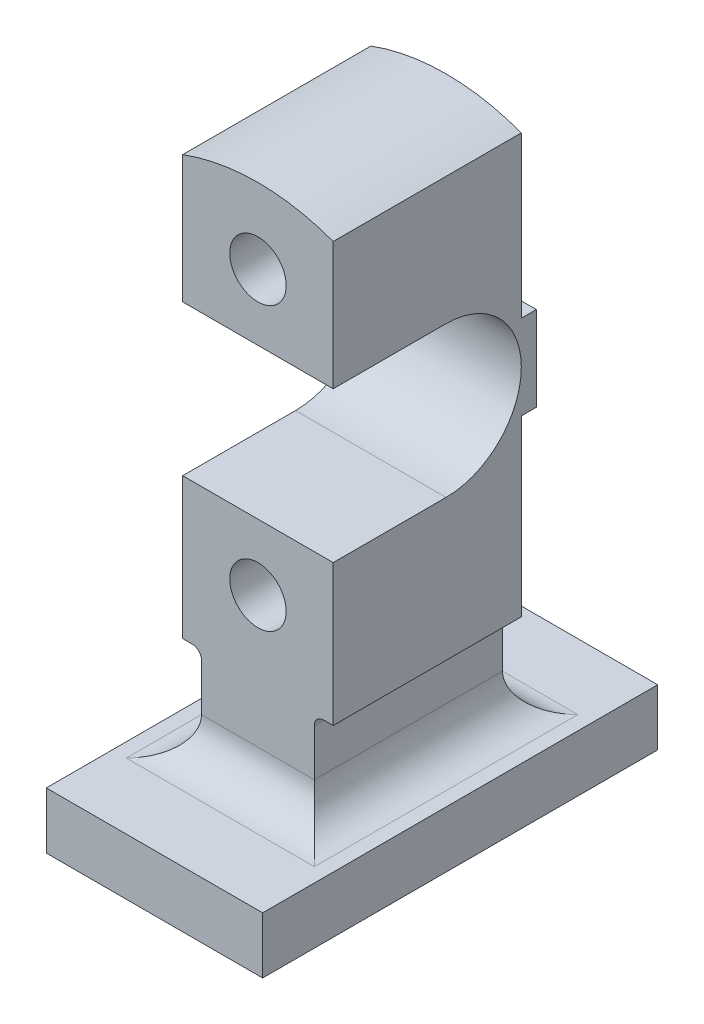
ISO-10303-21;
HEADER;
FILE_DESCRIPTION(('STEP AP214'),'2;1');
FILE_NAME('part.step','',(''),(''),'','','');
FILE_SCHEMA(('AUTOMOTIVE_DESIGN { 1 0 10303 214 1 1 1 1 }'));
ENDSEC;
DATA;
#1=APPLICATION_CONTEXT('core data for automotive mechanical design processes');
#2=APPLICATION_PROTOCOL_DEFINITION('international standard','automotive_design',2000,#1);
#3=PRODUCT_CONTEXT('',#1,'mechanical');
#4=PRODUCT('Part','Part','',(#3));
#5=PRODUCT_RELATED_PRODUCT_CATEGORY('part','',(#4));
#6=PRODUCT_DEFINITION_FORMATION('','',#4);
#7=PRODUCT_DEFINITION_CONTEXT('part definition',#1,'design');
#8=PRODUCT_DEFINITION('design','',#6,#7);
#9=PRODUCT_DEFINITION_SHAPE('','',#8);
#10=(LENGTH_UNIT() NAMED_UNIT(*) SI_UNIT(.MILLI.,.METRE.));
#11=(NAMED_UNIT(*) PLANE_ANGLE_UNIT() SI_UNIT($,.RADIAN.));
#12=(NAMED_UNIT(*) SI_UNIT($,.STERADIAN.) SOLID_ANGLE_UNIT());
#13=UNCERTAINTY_MEASURE_WITH_UNIT(LENGTH_MEASURE(1.E-05),#10,'distance_accuracy_value','');
#14=(GEOMETRIC_REPRESENTATION_CONTEXT(3) GLOBAL_UNCERTAINTY_ASSIGNED_CONTEXT((#13)) GLOBAL_UNIT_ASSIGNED_CONTEXT((#10,
#11,#12)) REPRESENTATION_CONTEXT('',''));
#15=CARTESIAN_POINT('',(0.,0.,0.));
#16=DIRECTION('',(0.,0.,1.));
#17=DIRECTION('',(1.,0.,0.));
#18=AXIS2_PLACEMENT_3D('',#15,#16,#17);
#19=CARTESIAN_POINT('',(115.,172.5,-155.));
#20=DIRECTION('',(0.,0.,1.));
#21=DIRECTION('',(1.,0.,0.));
#22=AXIS2_PLACEMENT_3D('',#19,#20,#21);
#23=PLANE('',#22);
#24=CARTESIAN_POINT('',(57.5,120.,-155.));
#25=DIRECTION('',(0.,0.,1.));
#26=DIRECTION('',(1.,0.,0.));
#27=AXIS2_PLACEMENT_3D('',#24,#25,#26);
#28=CIRCLE('',#27,15.);
#29=CARTESIAN_POINT('',(72.5,120.,-155.));
#30=VERTEX_POINT('',#29);
#31=EDGE_CURVE('E248',#30,#30,#28,.F.);
#32=ORIENTED_EDGE('',*,*,#31,.F.);
#33=EDGE_LOOP('',(#32));
#34=FACE_BOUND('',#33,.T.);
#35=DIRECTION('',(0.,1.,0.));
#36=VECTOR('',#35,1.);
#37=CARTESIAN_POINT('',(87.5000000000001,172.5,-155.));
#38=LINE('',#37,#36);
#39=CARTESIAN_POINT('',(87.5,50.0000000000001,-155.));
#40=VERTEX_POINT('',#39);
#41=CARTESIAN_POINT('',(87.5,75.,-155.));
#42=VERTEX_POINT('',#41);
#43=EDGE_CURVE('E297',#40,#42,#38,.T.);
#44=ORIENTED_EDGE('',*,*,#43,.F.);
#45=DIRECTION('',(-1.,0.,0.));
#46=VECTOR('',#45,1.);
#47=CARTESIAN_POINT('',(7.49999999999984,50.,-155.));
#48=LINE('',#47,#46);
#49=CARTESIAN_POINT('',(27.5,50.0000000000001,-155.));
#50=VERTEX_POINT('',#49);
#51=EDGE_CURVE('E227',#40,#50,#48,.T.);
#52=ORIENTED_EDGE('',*,*,#51,.T.);
#53=DIRECTION('',(0.,1.,0.));
#54=VECTOR('',#53,1.);
#55=CARTESIAN_POINT('',(27.5,172.5,-155.));
#56=LINE('',#55,#54);
#57=CARTESIAN_POINT('',(27.5,75.,-155.));
#58=VERTEX_POINT('',#57);
#59=EDGE_CURVE('E215',#50,#58,#56,.T.);
#60=ORIENTED_EDGE('',*,*,#59,.T.);
#61=CARTESIAN_POINT('',(22.5,75.,-155.));
#62=DIRECTION('',(0.,0.,1.));
#63=DIRECTION('',(1.,0.,0.));
#64=AXIS2_PLACEMENT_3D('',#61,#62,#63);
#65=CIRCLE('',#64,5.);
#66=CARTESIAN_POINT('',(22.5,80.,-155.));
#67=VERTEX_POINT('',#66);
#68=EDGE_CURVE('E291',#67,#58,#65,.F.);
#69=ORIENTED_EDGE('',*,*,#68,.F.);
#70=DIRECTION('',(1.,0.,0.));
#71=VECTOR('',#70,1.);
#72=CARTESIAN_POINT('',(115.,80.,-155.));
#73=LINE('',#72,#71);
#74=CARTESIAN_POINT('',(17.5,80.,-155.));
#75=VERTEX_POINT('',#74);
#76=EDGE_CURVE('E289',#75,#67,#73,.T.);
#77=ORIENTED_EDGE('',*,*,#76,.F.);
#78=DIRECTION('',(0.,1.,0.));
#79=VECTOR('',#78,1.);
#80=CARTESIAN_POINT('',(17.5,172.5,-155.));
#81=LINE('',#80,#79);
#82=CARTESIAN_POINT('',(17.5,172.5,-155.));
#83=VERTEX_POINT('',#82);
#84=EDGE_CURVE('E286',#75,#83,#81,.T.);
#85=ORIENTED_EDGE('',*,*,#84,.T.);
#86=DIRECTION('',(-1.,0.,0.));
#87=VECTOR('',#86,1.);
#88=CARTESIAN_POINT('',(115.,172.5,-155.));
#89=LINE('',#88,#87);
#90=CARTESIAN_POINT('',(97.5,172.5,-155.));
#91=VERTEX_POINT('',#90);
#92=EDGE_CURVE('E380',#91,#83,#89,.T.);
#93=ORIENTED_EDGE('',*,*,#92,.F.);
#94=DIRECTION('',(0.,1.,0.));
#95=VECTOR('',#94,1.);
#96=CARTESIAN_POINT('',(97.5,172.5,-155.));
#97=LINE('',#96,#95);
#98=CARTESIAN_POINT('',(97.5,80.,-155.));
#99=VERTEX_POINT('',#98);
#100=EDGE_CURVE('E333',#99,#91,#97,.T.);
#101=ORIENTED_EDGE('',*,*,#100,.F.);
#102=DIRECTION('',(1.,0.,0.));
#103=VECTOR('',#102,1.);
#104=CARTESIAN_POINT('',(115.,80.,-155.));
#105=LINE('',#104,#103);
#106=CARTESIAN_POINT('',(92.5,80.,-155.));
#107=VERTEX_POINT('',#106);
#108=EDGE_CURVE('E315',#107,#99,#105,.T.);
#109=ORIENTED_EDGE('',*,*,#108,.F.);
#110=CARTESIAN_POINT('',(92.5,75.,-155.));
#111=DIRECTION('',(0.,0.,1.));
#112=DIRECTION('',(1.,0.,0.));
#113=AXIS2_PLACEMENT_3D('',#110,#111,#112);
#114=CIRCLE('',#113,5.);
#115=EDGE_CURVE('E312',#107,#42,#114,.T.);
#116=ORIENTED_EDGE('',*,*,#115,.T.);
#117=EDGE_LOOP('',(#44,#52,#60,#69,#77,#85,#93,#101,#109,#116));
#118=FACE_BOUND('',#117,.T.);
#119=ADVANCED_FACE('F37',(#34,#118),#23,.F.);
#120=CARTESIAN_POINT('',(115.,155.,-55.));
#121=DIRECTION('',(0.,0.,-1.));
#122=DIRECTION('',(0.,1.,0.));
#123=AXIS2_PLACEMENT_3D('',#120,#121,#122);
#124=PLANE('',#123);
#125=CARTESIAN_POINT('',(57.5,120.,-55.));
#126=DIRECTION('',(0.,0.,-1.));
#127=DIRECTION('',(0.,1.,0.));
#128=AXIS2_PLACEMENT_3D('',#125,#126,#127);
#129=CIRCLE('',#128,15.);
#130=CARTESIAN_POINT('',(57.5,135.,-55.));
#131=VERTEX_POINT('',#130);
#132=EDGE_CURVE('E41',#131,#131,#129,.F.);
#133=ORIENTED_EDGE('',*,*,#132,.F.);
#134=EDGE_LOOP('',(#133));
#135=FACE_BOUND('',#134,.T.);
#136=DIRECTION('',(0.,-1.,0.));
#137=VECTOR('',#136,1.);
#138=CARTESIAN_POINT('',(27.5,155.,-55.));
#139=LINE('',#138,#137);
#140=CARTESIAN_POINT('',(27.5,75.,-55.));
#141=VERTEX_POINT('',#140);
#142=CARTESIAN_POINT('',(27.5,50.0000000000001,-55.));
#143=VERTEX_POINT('',#142);
#144=EDGE_CURVE('E212',#141,#143,#139,.T.);
#145=ORIENTED_EDGE('',*,*,#144,.T.);
#146=DIRECTION('',(-1.,0.,0.));
#147=VECTOR('',#146,1.);
#148=CARTESIAN_POINT('',(107.5,50.,-55.));
#149=LINE('',#148,#147);
#150=CARTESIAN_POINT('',(87.5,50.0000000000001,-55.));
#151=VERTEX_POINT('',#150);
#152=EDGE_CURVE('E223',#143,#151,#149,.F.);
#153=ORIENTED_EDGE('',*,*,#152,.T.);
#154=DIRECTION('',(0.,-1.,0.));
#155=VECTOR('',#154,1.);
#156=CARTESIAN_POINT('',(87.5,155.,-55.));
#157=LINE('',#156,#155);
#158=CARTESIAN_POINT('',(87.5,75.,-55.));
#159=VERTEX_POINT('',#158);
#160=EDGE_CURVE('E391',#159,#151,#157,.T.);
#161=ORIENTED_EDGE('',*,*,#160,.F.);
#162=CARTESIAN_POINT('',(92.5,75.,-55.));
#163=DIRECTION('',(0.,0.,-1.));
#164=DIRECTION('',(0.,1.,0.));
#165=AXIS2_PLACEMENT_3D('',#162,#163,#164);
#166=CIRCLE('',#165,5.);
#167=CARTESIAN_POINT('',(92.5,80.,-55.));
#168=VERTEX_POINT('',#167);
#169=EDGE_CURVE('E393',#159,#168,#166,.T.);
#170=ORIENTED_EDGE('',*,*,#169,.T.);
#171=DIRECTION('',(-1.,0.,0.));
#172=VECTOR('',#171,1.);
#173=CARTESIAN_POINT('',(115.,80.,-55.));
#174=LINE('',#173,#172);
#175=CARTESIAN_POINT('',(97.5,80.,-55.));
#176=VERTEX_POINT('',#175);
#177=EDGE_CURVE('E396',#176,#168,#174,.T.);
#178=ORIENTED_EDGE('',*,*,#177,.F.);
#179=DIRECTION('',(0.,-1.,0.));
#180=VECTOR('',#179,1.);
#181=CARTESIAN_POINT('',(97.5,155.,-55.));
#182=LINE('',#181,#180);
#183=CARTESIAN_POINT('',(97.5,155.,-55.));
#184=VERTEX_POINT('',#183);
#185=EDGE_CURVE('E398',#184,#176,#182,.T.);
#186=ORIENTED_EDGE('',*,*,#185,.F.);
#187=DIRECTION('',(-1.,0.,0.));
#188=VECTOR('',#187,1.);
#189=CARTESIAN_POINT('',(115.,155.,-55.));
#190=LINE('',#189,#188);
#191=CARTESIAN_POINT('',(17.5,155.,-55.));
#192=VERTEX_POINT('',#191);
#193=EDGE_CURVE('E359',#184,#192,#190,.T.);
#194=ORIENTED_EDGE('',*,*,#193,.T.);
#195=DIRECTION('',(0.,-1.,0.));
#196=VECTOR('',#195,1.);
#197=CARTESIAN_POINT('',(17.5,155.,-55.));
#198=LINE('',#197,#196);
#199=CARTESIAN_POINT('',(17.5,80.,-55.));
#200=VERTEX_POINT('',#199);
#201=EDGE_CURVE('E402',#192,#200,#198,.T.);
#202=ORIENTED_EDGE('',*,*,#201,.T.);
#203=DIRECTION('',(-1.,0.,0.));
#204=VECTOR('',#203,1.);
#205=CARTESIAN_POINT('',(115.,80.,-55.));
#206=LINE('',#205,#204);
#207=CARTESIAN_POINT('',(22.5,80.,-55.));
#208=VERTEX_POINT('',#207);
#209=EDGE_CURVE('E405',#208,#200,#206,.T.);
#210=ORIENTED_EDGE('',*,*,#209,.F.);
#211=CARTESIAN_POINT('',(22.5,75.,-55.));
#212=DIRECTION('',(0.,0.,-1.));
#213=DIRECTION('',(0.,1.,0.));
#214=AXIS2_PLACEMENT_3D('',#211,#212,#213);
#215=CIRCLE('',#214,5.);
#216=EDGE_CURVE('E226',#141,#208,#215,.F.);
#217=ORIENTED_EDGE('',*,*,#216,.F.);
#218=EDGE_LOOP('',(#145,#153,#161,#170,#178,#186,#194,#202,#210,#217));
#219=FACE_BOUND('',#218,.T.);
#220=ADVANCED_FACE('F221',(#135,#219),#124,.F.);
#221=CARTESIAN_POINT('',(115.,172.5,-163.));
#222=DIRECTION('',(0.,1.,0.));
#223=DIRECTION('',(0.,0.,1.));
#224=AXIS2_PLACEMENT_3D('',#221,#222,#223);
#225=PLANE('',#224);
#226=ORIENTED_EDGE('',*,*,#92,.T.);
#227=DIRECTION('',(0.,0.,-1.));
#228=VECTOR('',#227,1.);
#229=CARTESIAN_POINT('',(17.5,172.5,-163.));
#230=LINE('',#229,#228);
#231=CARTESIAN_POINT('',(17.5,172.5,-163.));
#232=VERTEX_POINT('',#231);
#233=EDGE_CURVE('E283',#83,#232,#230,.T.);
#234=ORIENTED_EDGE('',*,*,#233,.T.);
#235=DIRECTION('',(-1.,0.,0.));
#236=VECTOR('',#235,1.);
#237=CARTESIAN_POINT('',(115.,172.5,-163.));
#238=LINE('',#237,#236);
#239=CARTESIAN_POINT('',(97.5,172.5,-163.));
#240=VERTEX_POINT('',#239);
#241=EDGE_CURVE('E377',#240,#232,#238,.T.);
#242=ORIENTED_EDGE('',*,*,#241,.F.);
#243=DIRECTION('',(0.,0.,-1.));
#244=VECTOR('',#243,1.);
#245=CARTESIAN_POINT('',(97.5,172.5,-163.));
#246=LINE('',#245,#244);
#247=EDGE_CURVE('E331',#91,#240,#246,.T.);
#248=ORIENTED_EDGE('',*,*,#247,.F.);
#249=EDGE_LOOP('',(#226,#234,#242,#248));
#250=FACE_BOUND('',#249,.T.);
#251=ADVANCED_FACE('F439',(#250),#225,.F.);
#252=CARTESIAN_POINT('',(115.,217.5,-163.));
#253=DIRECTION('',(0.,0.,1.));
#254=DIRECTION('',(1.,0.,0.));
#255=AXIS2_PLACEMENT_3D('',#252,#253,#254);
#256=PLANE('',#255);
#257=ORIENTED_EDGE('',*,*,#241,.T.);
#258=DIRECTION('',(0.,1.,0.));
#259=VECTOR('',#258,1.);
#260=CARTESIAN_POINT('',(17.5,217.5,-163.));
#261=LINE('',#260,#259);
#262=CARTESIAN_POINT('',(17.5,217.5,-163.));
#263=VERTEX_POINT('',#262);
#264=EDGE_CURVE('E280',#232,#263,#261,.T.);
#265=ORIENTED_EDGE('',*,*,#264,.T.);
#266=DIRECTION('',(-1.,0.,0.));
#267=VECTOR('',#266,1.);
#268=CARTESIAN_POINT('',(115.,217.5,-163.));
#269=LINE('',#268,#267);
#270=CARTESIAN_POINT('',(97.5,217.5,-163.));
#271=VERTEX_POINT('',#270);
#272=EDGE_CURVE('E374',#271,#263,#269,.T.);
#273=ORIENTED_EDGE('',*,*,#272,.F.);
#274=DIRECTION('',(0.,1.,0.));
#275=VECTOR('',#274,1.);
#276=CARTESIAN_POINT('',(97.5,217.5,-163.));
#277=LINE('',#276,#275);
#278=EDGE_CURVE('E329',#240,#271,#277,.T.);
#279=ORIENTED_EDGE('',*,*,#278,.F.);
#280=EDGE_LOOP('',(#257,#265,#273,#279));
#281=FACE_BOUND('',#280,.T.);
#282=ADVANCED_FACE('F502',(#281),#256,.F.);
#283=CARTESIAN_POINT('',(115.,217.5,-163.));
#284=DIRECTION('',(0.,-1.,0.));
#285=DIRECTION('',(0.,0.,-1.));
#286=AXIS2_PLACEMENT_3D('',#283,#284,#285);
#287=PLANE('',#286);
#288=ORIENTED_EDGE('',*,*,#272,.T.);
#289=DIRECTION('',(0.,0.,1.));
#290=VECTOR('',#289,1.);
#291=CARTESIAN_POINT('',(17.5,217.5,-163.));
#292=LINE('',#291,#290);
#293=CARTESIAN_POINT('',(17.5,217.5,-155.));
#294=VERTEX_POINT('',#293);
#295=EDGE_CURVE('E277',#263,#294,#292,.T.);
#296=ORIENTED_EDGE('',*,*,#295,.T.);
#297=DIRECTION('',(-1.,0.,0.));
#298=VECTOR('',#297,1.);
#299=CARTESIAN_POINT('',(115.,217.5,-155.));
#300=LINE('',#299,#298);
#301=CARTESIAN_POINT('',(97.5,217.5,-155.));
#302=VERTEX_POINT('',#301);
#303=EDGE_CURVE('E371',#302,#294,#300,.T.);
#304=ORIENTED_EDGE('',*,*,#303,.F.);
#305=DIRECTION('',(0.,0.,1.));
#306=VECTOR('',#305,1.);
#307=CARTESIAN_POINT('',(97.5,217.5,-163.));
#308=LINE('',#307,#306);
#309=EDGE_CURVE('E327',#271,#302,#308,.T.);
#310=ORIENTED_EDGE('',*,*,#309,.F.);
#311=EDGE_LOOP('',(#288,#296,#304,#310));
#312=FACE_BOUND('',#311,.T.);
#313=ADVANCED_FACE('F499',(#312),#287,.F.);
#314=CARTESIAN_POINT('',(115.,310.,-155.));
#315=DIRECTION('',(0.,0.,1.));
#316=DIRECTION('',(1.,0.,0.));
#317=AXIS2_PLACEMENT_3D('',#314,#315,#316);
#318=PLANE('',#317);
#319=CARTESIAN_POINT('',(57.5,270.,-155.));
#320=DIRECTION('',(0.,0.,1.));
#321=DIRECTION('',(1.,0.,0.));
#322=AXIS2_PLACEMENT_3D('',#319,#320,#321);
#323=CIRCLE('',#322,15.);
#324=CARTESIAN_POINT('',(72.5,270.,-155.));
#325=VERTEX_POINT('',#324);
#326=EDGE_CURVE('E240',#325,#325,#323,.F.);
#327=ORIENTED_EDGE('',*,*,#326,.F.);
#328=EDGE_LOOP('',(#327));
#329=FACE_BOUND('',#328,.T.);
#330=ORIENTED_EDGE('',*,*,#303,.T.);
#331=DIRECTION('',(0.,1.,0.));
#332=VECTOR('',#331,1.);
#333=CARTESIAN_POINT('',(17.5,310.,-155.));
#334=LINE('',#333,#332);
#335=CARTESIAN_POINT('',(17.5,302.819293264239,-155.));
#336=VERTEX_POINT('',#335);
#337=EDGE_CURVE('E274',#294,#336,#334,.T.);
#338=ORIENTED_EDGE('',*,*,#337,.T.);
#339=CARTESIAN_POINT('',(57.5,195.,-155.));
#340=DIRECTION('',(0.,0.,1.));
#341=DIRECTION('',(1.,0.,0.));
#342=AXIS2_PLACEMENT_3D('',#339,#340,#341);
#343=CIRCLE('',#342,115.);
#344=CARTESIAN_POINT('',(97.5,302.819293264239,-155.));
#345=VERTEX_POINT('',#344);
#346=EDGE_CURVE('E335',#345,#336,#343,.T.);
#347=ORIENTED_EDGE('',*,*,#346,.F.);
#348=DIRECTION('',(0.,1.,0.));
#349=VECTOR('',#348,1.);
#350=CARTESIAN_POINT('',(97.5,310.,-155.));
#351=LINE('',#350,#349);
#352=EDGE_CURVE('E325',#302,#345,#351,.T.);
#353=ORIENTED_EDGE('',*,*,#352,.F.);
#354=EDGE_LOOP('',(#330,#338,#347,#353));
#355=FACE_BOUND('',#354,.T.);
#356=ADVANCED_FACE('F495',(#329,#355),#318,.F.);
#357=CARTESIAN_POINT('',(115.,310.,-55.));
#358=DIRECTION('',(0.,0.,-1.));
#359=DIRECTION('',(0.,1.,0.));
#360=AXIS2_PLACEMENT_3D('',#357,#358,#359);
#361=PLANE('',#360);
#362=CARTESIAN_POINT('',(57.5,270.,-55.));
#363=DIRECTION('',(0.,0.,-1.));
#364=DIRECTION('',(0.,1.,0.));
#365=AXIS2_PLACEMENT_3D('',#362,#363,#364);
#366=CIRCLE('',#365,15.);
#367=CARTESIAN_POINT('',(57.5,285.,-55.));
#368=VERTEX_POINT('',#367);
#369=EDGE_CURVE('E238',#368,#368,#366,.F.);
#370=ORIENTED_EDGE('',*,*,#369,.F.);
#371=EDGE_LOOP('',(#370));
#372=FACE_BOUND('',#371,.T.);
#373=CARTESIAN_POINT('',(57.5,195.,-55.));
#374=DIRECTION('',(0.,0.,-1.));
#375=DIRECTION('',(0.,1.,0.));
#376=AXIS2_PLACEMENT_3D('',#373,#374,#375);
#377=CIRCLE('',#376,115.);
#378=CARTESIAN_POINT('',(17.5,302.819293264239,-55.));
#379=VERTEX_POINT('',#378);
#380=CARTESIAN_POINT('',(97.5,302.819293264239,-55.));
#381=VERTEX_POINT('',#380);
#382=EDGE_CURVE('E400',#379,#381,#377,.T.);
#383=ORIENTED_EDGE('',*,*,#382,.F.);
#384=DIRECTION('',(0.,-1.,0.));
#385=VECTOR('',#384,1.);
#386=CARTESIAN_POINT('',(17.5,310.,-55.));
#387=LINE('',#386,#385);
#388=CARTESIAN_POINT('',(17.5,235.,-55.));
#389=VERTEX_POINT('',#388);
#390=EDGE_CURVE('E271',#379,#389,#387,.T.);
#391=ORIENTED_EDGE('',*,*,#390,.T.);
#392=DIRECTION('',(-1.,0.,0.));
#393=VECTOR('',#392,1.);
#394=CARTESIAN_POINT('',(115.,235.,-55.));
#395=LINE('',#394,#393);
#396=CARTESIAN_POINT('',(97.5,235.,-55.));
#397=VERTEX_POINT('',#396);
#398=EDGE_CURVE('E368',#397,#389,#395,.T.);
#399=ORIENTED_EDGE('',*,*,#398,.F.);
#400=DIRECTION('',(0.,-1.,0.));
#401=VECTOR('',#400,1.);
#402=CARTESIAN_POINT('',(97.5,310.,-55.));
#403=LINE('',#402,#401);
#404=EDGE_CURVE('E323',#381,#397,#403,.T.);
#405=ORIENTED_EDGE('',*,*,#404,.F.);
#406=EDGE_LOOP('',(#383,#391,#399,#405));
#407=FACE_BOUND('',#406,.T.);
#408=ADVANCED_FACE('F491',(#372,#407),#361,.F.);
#409=CARTESIAN_POINT('',(115.,235.,-55.));
#410=DIRECTION('',(0.,1.,0.));
#411=DIRECTION('',(0.,0.,1.));
#412=AXIS2_PLACEMENT_3D('',#409,#410,#411);
#413=PLANE('',#412);
#414=ORIENTED_EDGE('',*,*,#398,.T.);
#415=DIRECTION('',(0.,0.,-1.));
#416=VECTOR('',#415,1.);
#417=CARTESIAN_POINT('',(17.5,235.,-55.));
#418=LINE('',#417,#416);
#419=CARTESIAN_POINT('',(17.5,235.,-115.));
#420=VERTEX_POINT('',#419);
#421=EDGE_CURVE('E268',#389,#420,#418,.T.);
#422=ORIENTED_EDGE('',*,*,#421,.T.);
#423=DIRECTION('',(-1.,0.,0.));
#424=VECTOR('',#423,1.);
#425=CARTESIAN_POINT('',(115.,235.,-115.));
#426=LINE('',#425,#424);
#427=CARTESIAN_POINT('',(97.5,235.,-115.));
#428=VERTEX_POINT('',#427);
#429=EDGE_CURVE('E365',#428,#420,#426,.T.);
#430=ORIENTED_EDGE('',*,*,#429,.F.);
#431=DIRECTION('',(0.,0.,-1.));
#432=VECTOR('',#431,1.);
#433=CARTESIAN_POINT('',(97.5,235.,-55.));
#434=LINE('',#433,#432);
#435=EDGE_CURVE('E321',#397,#428,#434,.T.);
#436=ORIENTED_EDGE('',*,*,#435,.F.);
#437=EDGE_LOOP('',(#414,#422,#430,#436));
#438=FACE_BOUND('',#437,.T.);
#439=ADVANCED_FACE('F487',(#438),#413,.F.);
#440=CARTESIAN_POINT('',(115.,195.,-115.));
#441=DIRECTION('',(-1.,0.,0.));
#442=DIRECTION('',(0.,0.,1.));
#443=AXIS2_PLACEMENT_3D('',#440,#441,#442);
#444=CYLINDRICAL_SURFACE('',#443,40.);
#445=ORIENTED_EDGE('',*,*,#429,.T.);
#446=CARTESIAN_POINT('',(17.5,195.,-115.));
#447=DIRECTION('',(1.,0.,0.));
#448=DIRECTION('',(0.,1.,0.));
#449=AXIS2_PLACEMENT_3D('',#446,#447,#448);
#450=CIRCLE('',#449,40.);
#451=CARTESIAN_POINT('',(17.5,155.,-115.));
#452=VERTEX_POINT('',#451);
#453=EDGE_CURVE('E265',#420,#452,#450,.F.);
#454=ORIENTED_EDGE('',*,*,#453,.T.);
#455=DIRECTION('',(-1.,0.,0.));
#456=VECTOR('',#455,1.);
#457=CARTESIAN_POINT('',(115.,155.,-115.));
#458=LINE('',#457,#456);
#459=CARTESIAN_POINT('',(97.5,155.,-115.));
#460=VERTEX_POINT('',#459);
#461=EDGE_CURVE('E362',#460,#452,#458,.T.);
#462=ORIENTED_EDGE('',*,*,#461,.F.);
#463=CARTESIAN_POINT('',(97.5,195.,-115.));
#464=DIRECTION('',(1.,0.,0.));
#465=DIRECTION('',(0.,1.,0.));
#466=AXIS2_PLACEMENT_3D('',#463,#464,#465);
#467=CIRCLE('',#466,40.);
#468=EDGE_CURVE('E319',#428,#460,#467,.F.);
#469=ORIENTED_EDGE('',*,*,#468,.F.);
#470=EDGE_LOOP('',(#445,#454,#462,#469));
#471=FACE_BOUND('',#470,.T.);
#472=ADVANCED_FACE('F460',(#471),#444,.F.);
#473=CARTESIAN_POINT('',(115.,155.,-55.));
#474=DIRECTION('',(0.,-1.,0.));
#475=DIRECTION('',(0.,0.,-1.));
#476=AXIS2_PLACEMENT_3D('',#473,#474,#475);
#477=PLANE('',#476);
#478=ORIENTED_EDGE('',*,*,#461,.T.);
#479=DIRECTION('',(0.,0.,1.));
#480=VECTOR('',#479,1.);
#481=CARTESIAN_POINT('',(17.5,155.,-55.));
#482=LINE('',#481,#480);
#483=EDGE_CURVE('E216',#452,#192,#482,.T.);
#484=ORIENTED_EDGE('',*,*,#483,.T.);
#485=ORIENTED_EDGE('',*,*,#193,.F.);
#486=DIRECTION('',(0.,0.,1.));
#487=VECTOR('',#486,1.);
#488=CARTESIAN_POINT('',(97.5,155.,-55.));
#489=LINE('',#488,#487);
#490=EDGE_CURVE('E317',#460,#184,#489,.T.);
#491=ORIENTED_EDGE('',*,*,#490,.F.);
#492=EDGE_LOOP('',(#478,#484,#485,#491));
#493=FACE_BOUND('',#492,.T.);
#494=ADVANCED_FACE('F455',(#493),#477,.F.);
#495=CARTESIAN_POINT('',(115.,0.,0.));
#496=DIRECTION('',(0.,0.,-1.));
#497=DIRECTION('',(-1.,0.,0.));
#498=AXIS2_PLACEMENT_3D('',#495,#496,#497);
#499=PLANE('',#498);
#500=DIRECTION('',(0.,-1.,0.));
#501=VECTOR('',#500,1.);
#502=CARTESIAN_POINT('',(0.,0.,0.));
#503=LINE('',#502,#501);
#504=CARTESIAN_POINT('',(0.,30.,0.));
#505=VERTEX_POINT('',#504);
#506=CARTESIAN_POINT('',(0.,0.,0.));
#507=VERTEX_POINT('',#506);
#508=EDGE_CURVE('E337',#505,#507,#503,.T.);
#509=ORIENTED_EDGE('',*,*,#508,.T.);
#510=DIRECTION('',(-1.,0.,0.));
#511=VECTOR('',#510,1.);
#512=CARTESIAN_POINT('',(115.,0.,0.));
#513=LINE('',#512,#511);
#514=CARTESIAN_POINT('',(115.,0.,0.));
#515=VERTEX_POINT('',#514);
#516=EDGE_CURVE('E388',#515,#507,#513,.T.);
#517=ORIENTED_EDGE('',*,*,#516,.F.);
#518=DIRECTION('',(0.,-1.,0.));
#519=VECTOR('',#518,1.);
#520=CARTESIAN_POINT('',(115.,0.,0.));
#521=LINE('',#520,#519);
#522=CARTESIAN_POINT('',(115.,30.,0.));
#523=VERTEX_POINT('',#522);
#524=EDGE_CURVE('E338',#523,#515,#521,.T.);
#525=ORIENTED_EDGE('',*,*,#524,.F.);
#526=DIRECTION('',(-1.,0.,0.));
#527=VECTOR('',#526,1.);
#528=CARTESIAN_POINT('',(115.,30.,0.));
#529=LINE('',#528,#527);
#530=EDGE_CURVE('E348',#523,#505,#529,.T.);
#531=ORIENTED_EDGE('',*,*,#530,.T.);
#532=EDGE_LOOP('',(#509,#517,#525,#531));
#533=FACE_BOUND('',#532,.T.);
#534=ADVANCED_FACE('F452',(#533),#499,.F.);
#535=CARTESIAN_POINT('',(115.,0.,0.));
#536=DIRECTION('',(0.,1.,0.));
#537=DIRECTION('',(0.,0.,1.));
#538=AXIS2_PLACEMENT_3D('',#535,#536,#537);
#539=PLANE('',#538);
#540=DIRECTION('',(0.,0.,-1.));
#541=VECTOR('',#540,1.);
#542=CARTESIAN_POINT('',(0.,0.,0.));
#543=LINE('',#542,#541);
#544=CARTESIAN_POINT('',(0.,0.,-210.));
#545=VERTEX_POINT('',#544);
#546=EDGE_CURVE('E351',#507,#545,#543,.T.);
#547=ORIENTED_EDGE('',*,*,#546,.T.);
#548=DIRECTION('',(-1.,0.,0.));
#549=VECTOR('',#548,1.);
#550=CARTESIAN_POINT('',(115.,0.,-210.));
#551=LINE('',#550,#549);
#552=CARTESIAN_POINT('',(115.,0.,-210.));
#553=VERTEX_POINT('',#552);
#554=EDGE_CURVE('E385',#553,#545,#551,.T.);
#555=ORIENTED_EDGE('',*,*,#554,.F.);
#556=DIRECTION('',(0.,0.,-1.));
#557=VECTOR('',#556,1.);
#558=CARTESIAN_POINT('',(115.,0.,0.));
#559=LINE('',#558,#557);
#560=EDGE_CURVE('E341',#515,#553,#559,.T.);
#561=ORIENTED_EDGE('',*,*,#560,.F.);
#562=ORIENTED_EDGE('',*,*,#516,.T.);
#563=EDGE_LOOP('',(#547,#555,#561,#562));
#564=FACE_BOUND('',#563,.T.);
#565=ADVANCED_FACE('F449',(#564),#539,.F.);
#566=CARTESIAN_POINT('',(115.,0.,-210.));
#567=DIRECTION('',(0.,0.,1.));
#568=DIRECTION('',(1.,0.,0.));
#569=AXIS2_PLACEMENT_3D('',#566,#567,#568);
#570=PLANE('',#569);
#571=DIRECTION('',(0.,1.,0.));
#572=VECTOR('',#571,1.);
#573=CARTESIAN_POINT('',(0.,0.,-210.));
#574=LINE('',#573,#572);
#575=CARTESIAN_POINT('',(0.,30.,-210.));
#576=VERTEX_POINT('',#575);
#577=EDGE_CURVE('E353',#545,#576,#574,.T.);
#578=ORIENTED_EDGE('',*,*,#577,.T.);
#579=DIRECTION('',(-1.,0.,0.));
#580=VECTOR('',#579,1.);
#581=CARTESIAN_POINT('',(115.,30.,-210.));
#582=LINE('',#581,#580);
#583=CARTESIAN_POINT('',(115.,30.,-210.));
#584=VERTEX_POINT('',#583);
#585=EDGE_CURVE('E383',#584,#576,#582,.T.);
#586=ORIENTED_EDGE('',*,*,#585,.F.);
#587=DIRECTION('',(0.,1.,0.));
#588=VECTOR('',#587,1.);
#589=CARTESIAN_POINT('',(115.,0.,-210.));
#590=LINE('',#589,#588);
#591=EDGE_CURVE('E344',#553,#584,#590,.T.);
#592=ORIENTED_EDGE('',*,*,#591,.F.);
#593=ORIENTED_EDGE('',*,*,#554,.T.);
#594=EDGE_LOOP('',(#578,#586,#592,#593));
#595=FACE_BOUND('',#594,.T.);
#596=ADVANCED_FACE('F446',(#595),#570,.F.);
#597=CARTESIAN_POINT('',(115.,30.,0.));
#598=DIRECTION('',(0.,-1.,0.));
#599=DIRECTION('',(0.,0.,-1.));
#600=AXIS2_PLACEMENT_3D('',#597,#598,#599);
#601=PLANE('',#600);
#602=DIRECTION('',(0.,0.,-1.));
#603=VECTOR('',#602,1.);
#604=CARTESIAN_POINT('',(7.49999999999984,30.,0.));
#605=LINE('',#604,#603);
#606=CARTESIAN_POINT('',(7.49999999999984,30.,-35.));
#607=VERTEX_POINT('',#606);
#608=CARTESIAN_POINT('',(7.49999999999984,30.,-175.));
#609=VERTEX_POINT('',#608);
#610=EDGE_CURVE('E54',#607,#609,#605,.T.);
#611=ORIENTED_EDGE('',*,*,#610,.T.);
#612=DIRECTION('',(-1.,0.,0.));
#613=VECTOR('',#612,1.);
#614=CARTESIAN_POINT('',(107.5,30.,-175.));
#615=LINE('',#614,#613);
#616=CARTESIAN_POINT('',(107.5,30.,-175.));
#617=VERTEX_POINT('',#616);
#618=EDGE_CURVE('E231',#609,#617,#615,.F.);
#619=ORIENTED_EDGE('',*,*,#618,.T.);
#620=DIRECTION('',(0.,0.,-1.));
#621=VECTOR('',#620,1.);
#622=CARTESIAN_POINT('',(107.5,30.,0.));
#623=LINE('',#622,#621);
#624=CARTESIAN_POINT('',(107.5,30.,-35.));
#625=VERTEX_POINT('',#624);
#626=EDGE_CURVE('E61',#625,#617,#623,.T.);
#627=ORIENTED_EDGE('',*,*,#626,.F.);
#628=DIRECTION('',(-1.,0.,0.));
#629=VECTOR('',#628,1.);
#630=CARTESIAN_POINT('',(7.49999999999984,30.,-35.));
#631=LINE('',#630,#629);
#632=EDGE_CURVE('E234',#625,#607,#631,.T.);
#633=ORIENTED_EDGE('',*,*,#632,.T.);
#634=EDGE_LOOP('',(#611,#619,#627,#633));
#635=FACE_BOUND('',#634,.T.);
#636=ORIENTED_EDGE('',*,*,#585,.T.);
#637=DIRECTION('',(0.,0.,1.));
#638=VECTOR('',#637,1.);
#639=CARTESIAN_POINT('',(0.,30.,0.));
#640=LINE('',#639,#638);
#641=EDGE_CURVE('E342',#576,#505,#640,.T.);
#642=ORIENTED_EDGE('',*,*,#641,.T.);
#643=ORIENTED_EDGE('',*,*,#530,.F.);
#644=DIRECTION('',(0.,0.,1.));
#645=VECTOR('',#644,1.);
#646=CARTESIAN_POINT('',(115.,30.,-155.));
#647=LINE('',#646,#645);
#648=EDGE_CURVE('E346',#584,#523,#647,.T.);
#649=ORIENTED_EDGE('',*,*,#648,.F.);
#650=EDGE_LOOP('',(#636,#642,#643,#649));
#651=FACE_BOUND('',#650,.T.);
#652=ADVANCED_FACE('F409',(#635,#651),#601,.F.);
#653=CARTESIAN_POINT('',(115.,195.,-115.));
#654=DIRECTION('',(1.,0.,0.));
#655=DIRECTION('',(0.,0.,-1.));
#656=AXIS2_PLACEMENT_3D('',#653,#654,#655);
#657=PLANE('',#656);
#658=ORIENTED_EDGE('',*,*,#648,.T.);
#659=ORIENTED_EDGE('',*,*,#524,.T.);
#660=ORIENTED_EDGE('',*,*,#560,.T.);
#661=ORIENTED_EDGE('',*,*,#591,.T.);
#662=EDGE_LOOP('',(#658,#659,#660,#661));
#663=FACE_BOUND('',#662,.T.);
#664=ADVANCED_FACE('F474',(#663),#657,.T.);
#665=CARTESIAN_POINT('',(0.,195.,-115.));
#666=DIRECTION('',(1.,0.,0.));
#667=DIRECTION('',(0.,0.,-1.));
#668=AXIS2_PLACEMENT_3D('',#665,#666,#667);
#669=PLANE('',#668);
#670=ORIENTED_EDGE('',*,*,#641,.F.);
#671=ORIENTED_EDGE('',*,*,#577,.F.);
#672=ORIENTED_EDGE('',*,*,#546,.F.);
#673=ORIENTED_EDGE('',*,*,#508,.F.);
#674=EDGE_LOOP('',(#670,#671,#672,#673));
#675=FACE_BOUND('',#674,.T.);
#676=ADVANCED_FACE('F469',(#675),#669,.F.);
#677=CARTESIAN_POINT('',(57.5,195.,0.));
#678=DIRECTION('',(0.,0.,-1.));
#679=DIRECTION('',(-1.,0.,0.));
#680=AXIS2_PLACEMENT_3D('',#677,#678,#679);
#681=CYLINDRICAL_SURFACE('',#680,115.);
#682=ORIENTED_EDGE('',*,*,#346,.T.);
#683=DIRECTION('',(0.,0.,-1.));
#684=VECTOR('',#683,1.);
#685=CARTESIAN_POINT('',(17.5,302.819293264239,0.));
#686=LINE('',#685,#684);
#687=EDGE_CURVE('E259',#379,#336,#686,.T.);
#688=ORIENTED_EDGE('',*,*,#687,.F.);
#689=ORIENTED_EDGE('',*,*,#382,.T.);
#690=DIRECTION('',(0.,0.,-1.));
#691=VECTOR('',#690,1.);
#692=CARTESIAN_POINT('',(97.5,302.819293264239,0.));
#693=LINE('',#692,#691);
#694=EDGE_CURVE('E294',#381,#345,#693,.T.);
#695=ORIENTED_EDGE('',*,*,#694,.T.);
#696=EDGE_LOOP('',(#682,#688,#689,#695));
#697=FACE_BOUND('',#696,.T.);
#698=ADVANCED_FACE('F541',(#697),#681,.T.);
#699=CARTESIAN_POINT('',(97.5,0.,0.));
#700=DIRECTION('',(1.,0.,0.));
#701=DIRECTION('',(0.,1.,0.));
#702=AXIS2_PLACEMENT_3D('',#699,#700,#701);
#703=PLANE('',#702);
#704=ORIENTED_EDGE('',*,*,#100,.T.);
#705=ORIENTED_EDGE('',*,*,#247,.T.);
#706=ORIENTED_EDGE('',*,*,#278,.T.);
#707=ORIENTED_EDGE('',*,*,#309,.T.);
#708=ORIENTED_EDGE('',*,*,#352,.T.);
#709=ORIENTED_EDGE('',*,*,#694,.F.);
#710=ORIENTED_EDGE('',*,*,#404,.T.);
#711=ORIENTED_EDGE('',*,*,#435,.T.);
#712=ORIENTED_EDGE('',*,*,#468,.T.);
#713=ORIENTED_EDGE('',*,*,#490,.T.);
#714=ORIENTED_EDGE('',*,*,#185,.T.);
#715=DIRECTION('',(0.,0.,-1.));
#716=VECTOR('',#715,1.);
#717=CARTESIAN_POINT('',(97.5,80.,0.));
#718=LINE('',#717,#716);
#719=EDGE_CURVE('E298',#176,#99,#718,.T.);
#720=ORIENTED_EDGE('',*,*,#719,.T.);
#721=EDGE_LOOP('',(#704,#705,#706,#707,#708,#709,#710,#711,#712,#713,#714,#720));
#722=FACE_BOUND('',#721,.T.);
#723=ADVANCED_FACE('F537',(#722),#703,.T.);
#724=CARTESIAN_POINT('',(0.,80.,0.));
#725=DIRECTION('',(0.,-1.,0.));
#726=DIRECTION('',(0.,0.,-1.));
#727=AXIS2_PLACEMENT_3D('',#724,#725,#726);
#728=PLANE('',#727);
#729=ORIENTED_EDGE('',*,*,#108,.T.);
#730=ORIENTED_EDGE('',*,*,#719,.F.);
#731=ORIENTED_EDGE('',*,*,#177,.T.);
#732=DIRECTION('',(0.,0.,-1.));
#733=VECTOR('',#732,1.);
#734=CARTESIAN_POINT('',(92.5,80.,0.));
#735=LINE('',#734,#733);
#736=EDGE_CURVE('E301',#168,#107,#735,.T.);
#737=ORIENTED_EDGE('',*,*,#736,.T.);
#738=EDGE_LOOP('',(#729,#730,#731,#737));
#739=FACE_BOUND('',#738,.T.);
#740=ADVANCED_FACE('F540',(#739),#728,.T.);
#741=CARTESIAN_POINT('',(92.5,75.,0.));
#742=DIRECTION('',(0.,0.,-1.));
#743=DIRECTION('',(-1.,0.,0.));
#744=AXIS2_PLACEMENT_3D('',#741,#742,#743);
#745=CYLINDRICAL_SURFACE('',#744,5.);
#746=ORIENTED_EDGE('',*,*,#736,.F.);
#747=ORIENTED_EDGE('',*,*,#169,.F.);
#748=DIRECTION('',(0.,0.,-1.));
#749=VECTOR('',#748,1.);
#750=CARTESIAN_POINT('',(87.5,75.,0.));
#751=LINE('',#750,#749);
#752=EDGE_CURVE('E304',#159,#42,#751,.T.);
#753=ORIENTED_EDGE('',*,*,#752,.T.);
#754=ORIENTED_EDGE('',*,*,#115,.F.);
#755=EDGE_LOOP('',(#746,#747,#753,#754));
#756=FACE_BOUND('',#755,.T.);
#757=ADVANCED_FACE('F545',(#756),#745,.F.);
#758=CARTESIAN_POINT('',(87.5,0.,0.));
#759=DIRECTION('',(1.,0.,0.));
#760=DIRECTION('',(0.,1.,0.));
#761=AXIS2_PLACEMENT_3D('',#758,#759,#760);
#762=PLANE('',#761);
#763=ORIENTED_EDGE('',*,*,#43,.T.);
#764=ORIENTED_EDGE('',*,*,#752,.F.);
#765=ORIENTED_EDGE('',*,*,#160,.T.);
#766=DIRECTION('',(0.,0.,-1.));
#767=VECTOR('',#766,1.);
#768=CARTESIAN_POINT('',(87.5,50.0000000000001,0.));
#769=LINE('',#768,#767);
#770=EDGE_CURVE('E307',#151,#40,#769,.T.);
#771=ORIENTED_EDGE('',*,*,#770,.T.);
#772=EDGE_LOOP('',(#763,#764,#765,#771));
#773=FACE_BOUND('',#772,.T.);
#774=ADVANCED_FACE('F417',(#773),#762,.T.);
#775=CARTESIAN_POINT('',(107.5,50.,0.));
#776=DIRECTION('',(0.,0.,-1.));
#777=DIRECTION('',(-1.,0.,0.));
#778=AXIS2_PLACEMENT_3D('',#775,#776,#777);
#779=CYLINDRICAL_SURFACE('',#778,20.);
#780=ORIENTED_EDGE('',*,*,#770,.F.);
#781=CARTESIAN_POINT('',(107.5,50.,-35.));
#782=DIRECTION('',(0.707106781186547,0.,-0.707106781186547));
#783=DIRECTION('',(-0.707106781186547,0.,-0.707106781186547));
#784=AXIS2_PLACEMENT_3D('',#781,#782,#783);
#785=ELLIPSE('',#784,28.2842712474619,20.);
#786=EDGE_CURVE('E11',#151,#625,#785,.F.);
#787=ORIENTED_EDGE('',*,*,#786,.T.);
#788=ORIENTED_EDGE('',*,*,#626,.T.);
#789=CARTESIAN_POINT('',(107.5,50.,-175.));
#790=DIRECTION('',(-0.707106781186547,0.,-0.707106781186547));
#791=DIRECTION('',(0.707106781186547,0.,-0.707106781186547));
#792=AXIS2_PLACEMENT_3D('',#789,#790,#791);
#793=ELLIPSE('',#792,28.2842712474619,20.);
#794=EDGE_CURVE('E205',#617,#40,#793,.T.);
#795=ORIENTED_EDGE('',*,*,#794,.T.);
#796=EDGE_LOOP('',(#780,#787,#788,#795));
#797=FACE_BOUND('',#796,.T.);
#798=ADVANCED_FACE('F414',(#797),#779,.F.);
#799=CARTESIAN_POINT('',(27.5,0.,0.));
#800=DIRECTION('',(1.,0.,0.));
#801=DIRECTION('',(0.,0.,-1.));
#802=AXIS2_PLACEMENT_3D('',#799,#800,#801);
#803=PLANE('',#802);
#804=DIRECTION('',(0.,0.,-1.));
#805=VECTOR('',#804,1.);
#806=CARTESIAN_POINT('',(27.5,50.0000000000001,0.));
#807=LINE('',#806,#805);
#808=EDGE_CURVE('E201',#143,#50,#807,.T.);
#809=ORIENTED_EDGE('',*,*,#808,.F.);
#810=ORIENTED_EDGE('',*,*,#144,.F.);
#811=DIRECTION('',(0.,0.,-1.));
#812=VECTOR('',#811,1.);
#813=CARTESIAN_POINT('',(27.5,75.,0.));
#814=LINE('',#813,#812);
#815=EDGE_CURVE('E217',#141,#58,#814,.T.);
#816=ORIENTED_EDGE('',*,*,#815,.T.);
#817=ORIENTED_EDGE('',*,*,#59,.F.);
#818=EDGE_LOOP('',(#809,#810,#816,#817));
#819=FACE_BOUND('',#818,.T.);
#820=ADVANCED_FACE('F210',(#819),#803,.F.);
#821=CARTESIAN_POINT('',(22.5,75.,0.));
#822=DIRECTION('',(0.,0.,-1.));
#823=DIRECTION('',(-1.,0.,0.));
#824=AXIS2_PLACEMENT_3D('',#821,#822,#823);
#825=CYLINDRICAL_SURFACE('',#824,5.);
#826=ORIENTED_EDGE('',*,*,#68,.T.);
#827=ORIENTED_EDGE('',*,*,#815,.F.);
#828=ORIENTED_EDGE('',*,*,#216,.T.);
#829=DIRECTION('',(0.,0.,-1.));
#830=VECTOR('',#829,1.);
#831=CARTESIAN_POINT('',(22.5,80.,0.));
#832=LINE('',#831,#830);
#833=EDGE_CURVE('E253',#208,#67,#832,.T.);
#834=ORIENTED_EDGE('',*,*,#833,.T.);
#835=EDGE_LOOP('',(#826,#827,#828,#834));
#836=FACE_BOUND('',#835,.T.);
#837=ADVANCED_FACE('F524',(#836),#825,.F.);
#838=CARTESIAN_POINT('',(0.,80.,0.));
#839=DIRECTION('',(0.,-1.,0.));
#840=DIRECTION('',(0.,0.,-1.));
#841=AXIS2_PLACEMENT_3D('',#838,#839,#840);
#842=PLANE('',#841);
#843=ORIENTED_EDGE('',*,*,#76,.T.);
#844=ORIENTED_EDGE('',*,*,#833,.F.);
#845=ORIENTED_EDGE('',*,*,#209,.T.);
#846=DIRECTION('',(0.,0.,-1.));
#847=VECTOR('',#846,1.);
#848=CARTESIAN_POINT('',(17.5,80.,0.));
#849=LINE('',#848,#847);
#850=EDGE_CURVE('E256',#200,#75,#849,.T.);
#851=ORIENTED_EDGE('',*,*,#850,.T.);
#852=EDGE_LOOP('',(#843,#844,#845,#851));
#853=FACE_BOUND('',#852,.T.);
#854=ADVANCED_FACE('F522',(#853),#842,.T.);
#855=CARTESIAN_POINT('',(17.5,0.,0.));
#856=DIRECTION('',(1.,0.,0.));
#857=DIRECTION('',(0.,1.,0.));
#858=AXIS2_PLACEMENT_3D('',#855,#856,#857);
#859=PLANE('',#858);
#860=ORIENTED_EDGE('',*,*,#850,.F.);
#861=ORIENTED_EDGE('',*,*,#201,.F.);
#862=ORIENTED_EDGE('',*,*,#483,.F.);
#863=ORIENTED_EDGE('',*,*,#453,.F.);
#864=ORIENTED_EDGE('',*,*,#421,.F.);
#865=ORIENTED_EDGE('',*,*,#390,.F.);
#866=ORIENTED_EDGE('',*,*,#687,.T.);
#867=ORIENTED_EDGE('',*,*,#337,.F.);
#868=ORIENTED_EDGE('',*,*,#295,.F.);
#869=ORIENTED_EDGE('',*,*,#264,.F.);
#870=ORIENTED_EDGE('',*,*,#233,.F.);
#871=ORIENTED_EDGE('',*,*,#84,.F.);
#872=EDGE_LOOP('',(#860,#861,#862,#863,#864,#865,#866,#867,#868,#869,#870,#871));
#873=FACE_BOUND('',#872,.T.);
#874=ADVANCED_FACE('F430',(#873),#859,.F.);
#875=CARTESIAN_POINT('',(7.5,50.,0.));
#876=DIRECTION('',(0.,0.,-1.));
#877=DIRECTION('',(-1.,0.,0.));
#878=AXIS2_PLACEMENT_3D('',#875,#876,#877);
#879=CYLINDRICAL_SURFACE('',#878,20.);
#880=ORIENTED_EDGE('',*,*,#808,.T.);
#881=CARTESIAN_POINT('',(7.49999999999999,50.,-175.));
#882=DIRECTION('',(0.707106781186547,0.,-0.707106781186547));
#883=DIRECTION('',(0.707106781186547,0.,0.707106781186547));
#884=AXIS2_PLACEMENT_3D('',#881,#882,#883);
#885=ELLIPSE('',#884,28.2842712474619,20.);
#886=EDGE_CURVE('E230',#50,#609,#885,.T.);
#887=ORIENTED_EDGE('',*,*,#886,.T.);
#888=ORIENTED_EDGE('',*,*,#610,.F.);
#889=CARTESIAN_POINT('',(7.49999999999999,50.,-35.));
#890=DIRECTION('',(0.707106781186547,0.,0.707106781186547));
#891=DIRECTION('',(0.707106781186547,0.,-0.707106781186547));
#892=AXIS2_PLACEMENT_3D('',#889,#890,#891);
#893=ELLIPSE('',#892,28.2842712474619,20.);
#894=EDGE_CURVE('E46',#607,#143,#893,.T.);
#895=ORIENTED_EDGE('',*,*,#894,.T.);
#896=EDGE_LOOP('',(#880,#887,#888,#895));
#897=FACE_BOUND('',#896,.T.);
#898=ADVANCED_FACE('F200',(#897),#879,.F.);
#899=CARTESIAN_POINT('',(115.,50.,-175.));
#900=DIRECTION('',(1.,0.,0.));
#901=DIRECTION('',(0.,0.,-1.));
#902=AXIS2_PLACEMENT_3D('',#899,#900,#901);
#903=CYLINDRICAL_SURFACE('',#902,20.);
#904=ORIENTED_EDGE('',*,*,#794,.F.);
#905=ORIENTED_EDGE('',*,*,#618,.F.);
#906=ORIENTED_EDGE('',*,*,#886,.F.);
#907=ORIENTED_EDGE('',*,*,#51,.F.);
#908=EDGE_LOOP('',(#904,#905,#906,#907));
#909=FACE_BOUND('',#908,.T.);
#910=ADVANCED_FACE('F423',(#909),#903,.F.);
#911=CARTESIAN_POINT('',(115.,50.,-35.));
#912=DIRECTION('',(1.,0.,0.));
#913=DIRECTION('',(0.,0.,-1.));
#914=AXIS2_PLACEMENT_3D('',#911,#912,#913);
#915=CYLINDRICAL_SURFACE('',#914,20.);
#916=ORIENTED_EDGE('',*,*,#786,.F.);
#917=ORIENTED_EDGE('',*,*,#152,.F.);
#918=ORIENTED_EDGE('',*,*,#894,.F.);
#919=ORIENTED_EDGE('',*,*,#632,.F.);
#920=EDGE_LOOP('',(#916,#917,#918,#919));
#921=FACE_BOUND('',#920,.T.);
#922=ADVANCED_FACE('F39',(#921),#915,.F.);
#923=CARTESIAN_POINT('',(57.5,270.,-210.));
#924=DIRECTION('',(0.,0.,1.));
#925=DIRECTION('',(1.,0.,0.));
#926=AXIS2_PLACEMENT_3D('',#923,#924,#925);
#927=CYLINDRICAL_SURFACE('',#926,15.);
#928=ORIENTED_EDGE('',*,*,#369,.T.);
#929=EDGE_LOOP('',(#928));
#930=FACE_BOUND('',#929,.T.);
#931=ORIENTED_EDGE('',*,*,#326,.T.);
#932=EDGE_LOOP('',(#931));
#933=FACE_BOUND('',#932,.T.);
#934=ADVANCED_FACE('F429',(#930,#933),#927,.F.);
#935=CARTESIAN_POINT('',(57.5,120.,-210.));
#936=DIRECTION('',(0.,0.,1.));
#937=DIRECTION('',(1.,0.,0.));
#938=AXIS2_PLACEMENT_3D('',#935,#936,#937);
#939=CYLINDRICAL_SURFACE('',#938,15.);
#940=ORIENTED_EDGE('',*,*,#132,.T.);
#941=EDGE_LOOP('',(#940));
#942=FACE_BOUND('',#941,.T.);
#943=ORIENTED_EDGE('',*,*,#31,.T.);
#944=EDGE_LOOP('',(#943));
#945=FACE_BOUND('',#944,.T.);
#946=ADVANCED_FACE('F812',(#942,#945),#939,.F.);
#947=CLOSED_SHELL('',(#119,#220,#251,#282,#313,#356,#408,#439,#472,#494,#534,#565,#596,#652,
#664,#676,#698,#723,#740,#757,#774,#798,#820,#837,#854,#874,#898,#910,#922,#934,#946));
#948=MANIFOLD_SOLID_BREP('B2',#947);
#949=ADVANCED_BREP_SHAPE_REPRESENTATION('',(#18,#948),#14);
#950=SHAPE_DEFINITION_REPRESENTATION(#9,#949);
ENDSEC;
END-ISO-10303-21;
